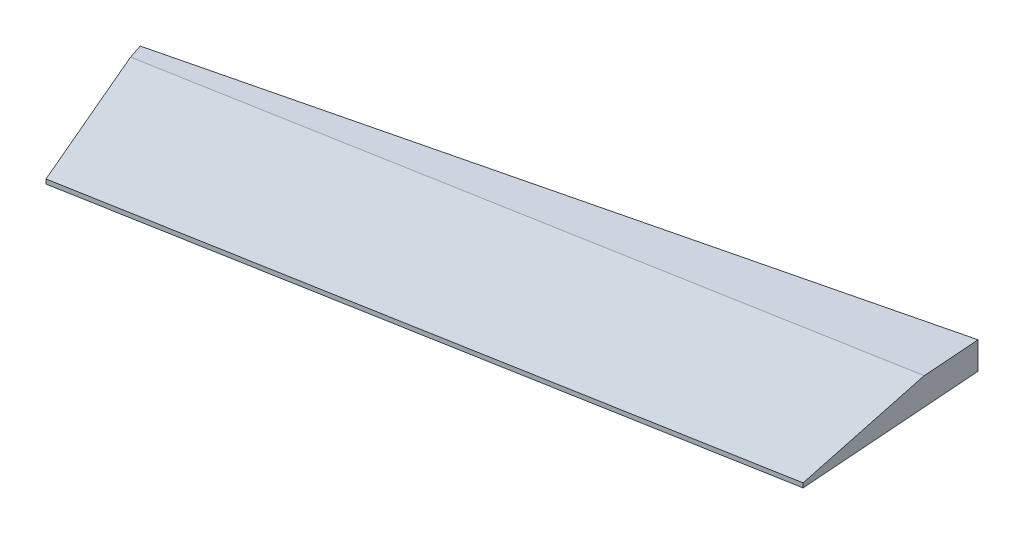
ISO-10303-21;
HEADER;
FILE_DESCRIPTION(('STEP AP214'),'2;1');
FILE_NAME('part.step','',(''),(''),'','','');
FILE_SCHEMA(('AUTOMOTIVE_DESIGN { 1 0 10303 214 1 1 1 1 }'));
ENDSEC;
DATA;
#1=APPLICATION_CONTEXT('core data for automotive mechanical design processes');
#2=APPLICATION_PROTOCOL_DEFINITION('international standard','automotive_design',2000,#1);
#3=PRODUCT_CONTEXT('',#1,'mechanical');
#4=PRODUCT('Part','Part','',(#3));
#5=PRODUCT_RELATED_PRODUCT_CATEGORY('part','',(#4));
#6=PRODUCT_DEFINITION_FORMATION('','',#4);
#7=PRODUCT_DEFINITION_CONTEXT('part definition',#1,'design');
#8=PRODUCT_DEFINITION('design','',#6,#7);
#9=PRODUCT_DEFINITION_SHAPE('','',#8);
#10=(LENGTH_UNIT() NAMED_UNIT(*) SI_UNIT(.MILLI.,.METRE.));
#11=(NAMED_UNIT(*) PLANE_ANGLE_UNIT() SI_UNIT($,.RADIAN.));
#12=(NAMED_UNIT(*) SI_UNIT($,.STERADIAN.) SOLID_ANGLE_UNIT());
#13=UNCERTAINTY_MEASURE_WITH_UNIT(LENGTH_MEASURE(1.E-05),#10,'distance_accuracy_value','');
#14=(GEOMETRIC_REPRESENTATION_CONTEXT(3) GLOBAL_UNCERTAINTY_ASSIGNED_CONTEXT((#13)) GLOBAL_UNIT_ASSIGNED_CONTEXT((#10,
#11,#12)) REPRESENTATION_CONTEXT('',''));
#15=CARTESIAN_POINT('',(0.,0.,0.));
#16=DIRECTION('',(0.,0.,1.));
#17=DIRECTION('',(1.,0.,0.));
#18=AXIS2_PLACEMENT_3D('',#15,#16,#17);
#19=CARTESIAN_POINT('',(352.263248298163,-8.89,717.230631167763));
#20=DIRECTION('',(-0.237376568274056,0.,-0.971417708730097));
#21=DIRECTION('',(-0.971417708730097,0.,0.237376568274056));
#22=AXIS2_PLACEMENT_3D('',#19,#20,#21);
#23=PLANE('',#22);
#24=DIRECTION('',(-0.971417708730097,0.,0.237376568274056));
#25=VECTOR('',#24,1.);
#26=CARTESIAN_POINT('',(352.263248298163,0.,717.230631167763));
#27=LINE('',#26,#25);
#28=CARTESIAN_POINT('',(352.263248298163,0.,717.230631167763));
#29=VERTEX_POINT('',#28);
#30=CARTESIAN_POINT('',(133.286430851597,0.,770.740017490349));
#31=VERTEX_POINT('',#30);
#32=EDGE_CURVE('E112',#29,#31,#27,.T.);
#33=ORIENTED_EDGE('',*,*,#32,.F.);
#34=DIRECTION('',(0.,1.,0.));
#35=VECTOR('',#34,1.);
#36=CARTESIAN_POINT('',(352.263248298163,-8.89,717.230631167763));
#37=LINE('',#36,#35);
#38=CARTESIAN_POINT('',(352.263248298163,-8.89,717.230631167763));
#39=VERTEX_POINT('',#38);
#40=EDGE_CURVE('E105',#39,#29,#37,.T.);
#41=ORIENTED_EDGE('',*,*,#40,.F.);
#42=DIRECTION('',(-0.971417708730097,0.,0.237376568274056));
#43=VECTOR('',#42,1.);
#44=CARTESIAN_POINT('',(352.263248298163,-8.89,717.230631167763));
#45=LINE('',#44,#43);
#46=CARTESIAN_POINT('',(133.286430851597,-8.89,770.740017490349));
#47=VERTEX_POINT('',#46);
#48=EDGE_CURVE('E99',#39,#47,#45,.T.);
#49=ORIENTED_EDGE('',*,*,#48,.T.);
#50=DIRECTION('',(0.,1.,0.));
#51=VECTOR('',#50,1.);
#52=CARTESIAN_POINT('',(133.286430851597,-8.89,770.740017490349));
#53=LINE('',#52,#51);
#54=EDGE_CURVE('E81',#47,#31,#53,.T.);
#55=ORIENTED_EDGE('',*,*,#54,.T.);
#56=EDGE_LOOP('',(#33,#41,#49,#55));
#57=FACE_BOUND('',#56,.T.);
#58=ADVANCED_FACE('F35',(#57),#23,.T.);
#59=CARTESIAN_POINT('',(356.664774137385,-8.89,778.521640104813));
#60=DIRECTION('',(0.997431337008312,0.,-0.0716290999092653));
#61=DIRECTION('',(-0.0716290999092653,0.,-0.997431337008312));
#62=AXIS2_PLACEMENT_3D('',#59,#60,#61);
#63=PLANE('',#62);
#64=DIRECTION('',(-0.0716290999092654,0.,-0.997431337008312));
#65=VECTOR('',#64,1.);
#66=CARTESIAN_POINT('',(356.664774137385,0.,778.521640104813));
#67=LINE('',#66,#65);
#68=CARTESIAN_POINT('',(353.617126487591,0.,736.083311633356));
#69=VERTEX_POINT('',#68);
#70=EDGE_CURVE('E106',#69,#29,#67,.T.);
#71=ORIENTED_EDGE('',*,*,#70,.F.);
#72=DIRECTION('',(-0.0705528532404794,0.17269853528165,-0.982444660431925));
#73=VECTOR('',#72,1.);
#74=CARTESIAN_POINT('',(356.682197792798,-7.50264944124647,778.764263562821));
#75=LINE('',#74,#73);
#76=CARTESIAN_POINT('',(356.664774137385,-7.46000000000002,778.521640104813));
#77=VERTEX_POINT('',#76);
#78=EDGE_CURVE('E58',#69,#77,#75,.F.);
#79=ORIENTED_EDGE('',*,*,#78,.T.);
#80=DIRECTION('',(0.,1.,0.));
#81=VECTOR('',#80,1.);
#82=CARTESIAN_POINT('',(356.664774137385,-8.89,778.521640104813));
#83=LINE('',#82,#81);
#84=CARTESIAN_POINT('',(356.664774137385,-8.89,778.521640104813));
#85=VERTEX_POINT('',#84);
#86=EDGE_CURVE('E117',#85,#77,#83,.T.);
#87=ORIENTED_EDGE('',*,*,#86,.F.);
#88=DIRECTION('',(-0.0716290999092654,0.,-0.997431337008312));
#89=VECTOR('',#88,1.);
#90=CARTESIAN_POINT('',(356.664774137385,-8.89,778.521640104813));
#91=LINE('',#90,#89);
#92=EDGE_CURVE('E92',#85,#39,#91,.T.);
#93=ORIENTED_EDGE('',*,*,#92,.T.);
#94=ORIENTED_EDGE('',*,*,#40,.T.);
#95=EDGE_LOOP('',(#71,#79,#87,#93,#94));
#96=FACE_BOUND('',#95,.T.);
#97=ADVANCED_FACE('F127',(#96),#63,.T.);
#98=CARTESIAN_POINT('',(147.934191067058,-8.89,816.056525656933));
#99=DIRECTION('',(0.176985745640905,0.,0.984213414783569));
#100=DIRECTION('',(0.984213414783569,0.,-0.176985745640905));
#101=AXIS2_PLACEMENT_3D('',#98,#99,#100);
#102=PLANE('',#101);
#103=ORIENTED_EDGE('',*,*,#86,.T.);
#104=DIRECTION('',(-0.984213414783569,0.,0.176985745640905));
#105=VECTOR('',#104,1.);
#106=CARTESIAN_POINT('',(147.934191067058,-7.46000000000002,816.056525656933));
#107=LINE('',#106,#105);
#108=CARTESIAN_POINT('',(147.934191067058,-7.46000000000002,816.056525656933));
#109=VERTEX_POINT('',#108);
#110=EDGE_CURVE('E44',#77,#109,#107,.T.);
#111=ORIENTED_EDGE('',*,*,#110,.T.);
#112=DIRECTION('',(0.,1.,0.));
#113=VECTOR('',#112,1.);
#114=CARTESIAN_POINT('',(147.934191067058,-8.89,816.056525656933));
#115=LINE('',#114,#113);
#116=CARTESIAN_POINT('',(147.934191067058,-8.89,816.056525656933));
#117=VERTEX_POINT('',#116);
#118=EDGE_CURVE('E91',#117,#109,#115,.T.);
#119=ORIENTED_EDGE('',*,*,#118,.F.);
#120=DIRECTION('',(0.984213414783568,0.,-0.176985745640905));
#121=VECTOR('',#120,1.);
#122=CARTESIAN_POINT('',(147.934191067058,-8.89,816.056525656933));
#123=LINE('',#122,#121);
#124=EDGE_CURVE('E102',#117,#85,#123,.T.);
#125=ORIENTED_EDGE('',*,*,#124,.T.);
#126=EDGE_LOOP('',(#103,#111,#119,#125));
#127=FACE_BOUND('',#126,.T.);
#128=ADVANCED_FACE('F128',(#127),#102,.T.);
#129=CARTESIAN_POINT('',(133.286430851597,-8.89,770.740017490349));
#130=DIRECTION('',(-0.951527276037781,0.,0.307564372052616));
#131=DIRECTION('',(0.307564372052616,0.,0.951527276037781));
#132=AXIS2_PLACEMENT_3D('',#129,#130,#131);
#133=PLANE('',#132);
#134=ORIENTED_EDGE('',*,*,#118,.T.);
#135=DIRECTION('',(0.302974180860269,-0.17212181156675,0.937326372036458));
#136=VECTOR('',#135,1.);
#137=CARTESIAN_POINT('',(133.794956499634,0.572600867183257,772.313268713963));
#138=LINE('',#137,#136);
#139=CARTESIAN_POINT('',(134.802866404343,0.,775.431489981659));
#140=VERTEX_POINT('',#139);
#141=EDGE_CURVE('E11',#109,#140,#138,.F.);
#142=ORIENTED_EDGE('',*,*,#141,.T.);
#143=DIRECTION('',(0.307564372052616,0.,0.951527276037781));
#144=VECTOR('',#143,1.);
#145=CARTESIAN_POINT('',(133.286430851597,0.,770.740017490349));
#146=LINE('',#145,#144);
#147=EDGE_CURVE('E86',#31,#140,#146,.T.);
#148=ORIENTED_EDGE('',*,*,#147,.F.);
#149=ORIENTED_EDGE('',*,*,#54,.F.);
#150=DIRECTION('',(0.307564372052616,0.,0.951527276037781));
#151=VECTOR('',#150,1.);
#152=CARTESIAN_POINT('',(133.286430851597,-8.89,770.740017490349));
#153=LINE('',#152,#151);
#154=EDGE_CURVE('E84',#47,#117,#153,.T.);
#155=ORIENTED_EDGE('',*,*,#154,.T.);
#156=EDGE_LOOP('',(#134,#142,#148,#149,#155));
#157=FACE_BOUND('',#156,.T.);
#158=ADVANCED_FACE('F83',(#157),#133,.T.);
#159=CARTESIAN_POINT('',(0.,-8.89,0.));
#160=DIRECTION('',(0.,1.,0.));
#161=DIRECTION('',(0.,0.,1.));
#162=AXIS2_PLACEMENT_3D('',#159,#160,#161);
#163=PLANE('',#162);
#164=ORIENTED_EDGE('',*,*,#48,.F.);
#165=ORIENTED_EDGE('',*,*,#92,.F.);
#166=ORIENTED_EDGE('',*,*,#124,.F.);
#167=ORIENTED_EDGE('',*,*,#154,.F.);
#168=EDGE_LOOP('',(#164,#165,#166,#167));
#169=FACE_BOUND('',#168,.T.);
#170=ADVANCED_FACE('F97',(#169),#163,.F.);
#171=CARTESIAN_POINT('',(0.,0.,0.));
#172=DIRECTION('',(0.,1.,0.));
#173=DIRECTION('',(0.,0.,1.));
#174=AXIS2_PLACEMENT_3D('',#171,#172,#173);
#175=PLANE('',#174);
#176=ORIENTED_EDGE('',*,*,#147,.T.);
#177=DIRECTION('',(0.984213414783569,0.,-0.176985745640905));
#178=VECTOR('',#177,1.);
#179=CARTESIAN_POINT('',(139.296323241857,0.,774.623456076668));
#180=LINE('',#179,#178);
#181=EDGE_CURVE('E116',#140,#69,#180,.T.);
#182=ORIENTED_EDGE('',*,*,#181,.T.);
#183=ORIENTED_EDGE('',*,*,#70,.T.);
#184=ORIENTED_EDGE('',*,*,#32,.T.);
#185=EDGE_LOOP('',(#176,#182,#183,#184));
#186=FACE_BOUND('',#185,.T.);
#187=ADVANCED_FACE('F124',(#186),#175,.T.);
#188=CARTESIAN_POINT('',(139.296323241857,0.,774.623456076668));
#189=DIRECTION('',(-0.0307332522035655,-0.984807753012208,-0.17090686591251));
#190=DIRECTION('',(0.984213414783569,0.,-0.176985745640905));
#191=AXIS2_PLACEMENT_3D('',#188,#189,#190);
#192=PLANE('',#191);
#193=ORIENTED_EDGE('',*,*,#141,.F.);
#194=ORIENTED_EDGE('',*,*,#110,.F.);
#195=ORIENTED_EDGE('',*,*,#78,.F.);
#196=ORIENTED_EDGE('',*,*,#181,.F.);
#197=EDGE_LOOP('',(#193,#194,#195,#196));
#198=FACE_BOUND('',#197,.T.);
#199=ADVANCED_FACE('F38',(#198),#192,.F.);
#200=CLOSED_SHELL('',(#58,#97,#128,#158,#170,#187,#199));
#201=MANIFOLD_SOLID_BREP('B2',#200);
#202=ADVANCED_BREP_SHAPE_REPRESENTATION('',(#18,#201),#14);
#203=SHAPE_DEFINITION_REPRESENTATION(#9,#202);
ENDSEC;
END-ISO-10303-21;
